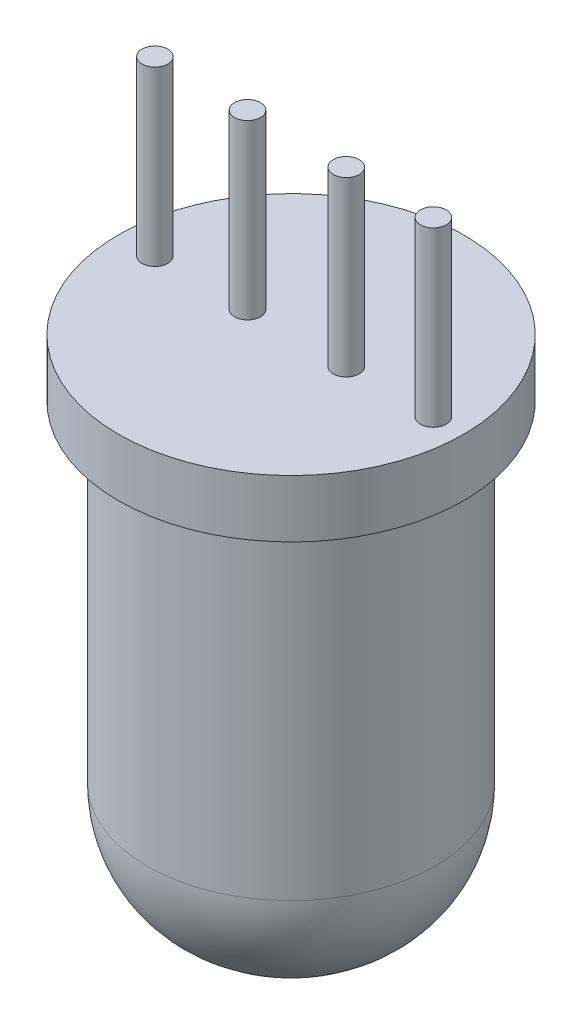
ISO-10303-21;
HEADER;
FILE_DESCRIPTION(('STEP AP214'),'2;1');
FILE_NAME('part.step','',(''),(''),'','','');
FILE_SCHEMA(('AUTOMOTIVE_DESIGN { 1 0 10303 214 1 1 1 1 }'));
ENDSEC;
DATA;
#1=APPLICATION_CONTEXT('core data for automotive mechanical design processes');
#2=APPLICATION_PROTOCOL_DEFINITION('international standard','automotive_design',2000,#1);
#3=PRODUCT_CONTEXT('',#1,'mechanical');
#4=PRODUCT('Part','Part','',(#3));
#5=PRODUCT_RELATED_PRODUCT_CATEGORY('part','',(#4));
#6=PRODUCT_DEFINITION_FORMATION('','',#4);
#7=PRODUCT_DEFINITION_CONTEXT('part definition',#1,'design');
#8=PRODUCT_DEFINITION('design','',#6,#7);
#9=PRODUCT_DEFINITION_SHAPE('','',#8);
#10=(LENGTH_UNIT() NAMED_UNIT(*) SI_UNIT(.MILLI.,.METRE.));
#11=(NAMED_UNIT(*) PLANE_ANGLE_UNIT() SI_UNIT($,.RADIAN.));
#12=(NAMED_UNIT(*) SI_UNIT($,.STERADIAN.) SOLID_ANGLE_UNIT());
#13=UNCERTAINTY_MEASURE_WITH_UNIT(LENGTH_MEASURE(1.E-05),#10,'distance_accuracy_value','');
#14=(GEOMETRIC_REPRESENTATION_CONTEXT(3) GLOBAL_UNCERTAINTY_ASSIGNED_CONTEXT((#13)) GLOBAL_UNIT_ASSIGNED_CONTEXT((#10,
#11,#12)) REPRESENTATION_CONTEXT('',''));
#15=CARTESIAN_POINT('',(0.,0.,0.));
#16=DIRECTION('',(0.,0.,1.));
#17=DIRECTION('',(1.,0.,0.));
#18=AXIS2_PLACEMENT_3D('',#15,#16,#17);
#19=CARTESIAN_POINT('',(0.,9.,0.));
#20=DIRECTION('',(0.,-1.,0.));
#21=DIRECTION('',(0.,0.,-1.));
#22=AXIS2_PLACEMENT_3D('',#19,#20,#21);
#23=CYLINDRICAL_SURFACE('',#22,2.5);
#24=CARTESIAN_POINT('',(0.,2.25,0.));
#25=DIRECTION('',(0.,1.,0.));
#26=DIRECTION('',(0.,0.,1.));
#27=AXIS2_PLACEMENT_3D('',#24,#25,#26);
#28=CIRCLE('',#27,2.5);
#29=CARTESIAN_POINT('',(0.,2.25,2.5));
#30=VERTEX_POINT('',#29);
#31=EDGE_CURVE('E40',#30,#30,#28,.T.);
#32=ORIENTED_EDGE('',*,*,#31,.T.);
#33=EDGE_LOOP('',(#32));
#34=FACE_BOUND('',#33,.T.);
#35=CARTESIAN_POINT('',(0.,8.,0.));
#36=DIRECTION('',(0.,1.,0.));
#37=DIRECTION('',(0.,0.,1.));
#38=AXIS2_PLACEMENT_3D('',#35,#36,#37);
#39=CIRCLE('',#38,2.5);
#40=CARTESIAN_POINT('',(0.,8.,2.5));
#41=VERTEX_POINT('',#40);
#42=EDGE_CURVE('E44',#41,#41,#39,.T.);
#43=ORIENTED_EDGE('',*,*,#42,.F.);
#44=EDGE_LOOP('',(#43));
#45=FACE_BOUND('',#44,.T.);
#46=ADVANCED_FACE('F33',(#34,#45),#23,.T.);
#47=CARTESIAN_POINT('',(0.,0.,0.));
#48=DIRECTION('',(0.,1.,0.));
#49=DIRECTION('',(0.,0.,1.));
#50=AXIS2_PLACEMENT_3D('',#47,#48,#49);
#51=PLANE('',#50);
#52=CARTESIAN_POINT('',(0.,0.,0.));
#53=DIRECTION('',(0.,1.,0.));
#54=DIRECTION('',(0.,0.,1.));
#55=AXIS2_PLACEMENT_3D('',#52,#53,#54);
#56=CIRCLE('',#55,0.25);
#57=CARTESIAN_POINT('',(0.,0.,0.25));
#58=VERTEX_POINT('',#57);
#59=EDGE_CURVE('E10',#58,#58,#56,.F.);
#60=ORIENTED_EDGE('',*,*,#59,.T.);
#61=EDGE_LOOP('',(#60));
#62=FACE_BOUND('',#61,.T.);
#63=ADVANCED_FACE('F105',(#62),#51,.F.);
#64=CARTESIAN_POINT('',(0.,8.,0.));
#65=DIRECTION('',(0.,1.,0.));
#66=DIRECTION('',(0.,0.,1.));
#67=AXIS2_PLACEMENT_3D('',#64,#65,#66);
#68=CYLINDRICAL_SURFACE('',#67,3.);
#69=CARTESIAN_POINT('',(0.,8.,0.));
#70=DIRECTION('',(0.,1.,0.));
#71=DIRECTION('',(0.,0.,1.));
#72=AXIS2_PLACEMENT_3D('',#69,#70,#71);
#73=CIRCLE('',#72,3.);
#74=CARTESIAN_POINT('',(0.,8.,3.));
#75=VERTEX_POINT('',#74);
#76=EDGE_CURVE('E48',#75,#75,#73,.T.);
#77=ORIENTED_EDGE('',*,*,#76,.T.);
#78=EDGE_LOOP('',(#77));
#79=FACE_BOUND('',#78,.T.);
#80=CARTESIAN_POINT('',(0.,9.,0.));
#81=DIRECTION('',(0.,1.,0.));
#82=DIRECTION('',(0.,0.,1.));
#83=AXIS2_PLACEMENT_3D('',#80,#81,#82);
#84=CIRCLE('',#83,3.);
#85=CARTESIAN_POINT('',(0.,9.,3.));
#86=VERTEX_POINT('',#85);
#87=EDGE_CURVE('E51',#86,#86,#84,.T.);
#88=ORIENTED_EDGE('',*,*,#87,.F.);
#89=EDGE_LOOP('',(#88));
#90=FACE_BOUND('',#89,.T.);
#91=ADVANCED_FACE('F103',(#79,#90),#68,.T.);
#92=CARTESIAN_POINT('',(0.,8.,0.));
#93=DIRECTION('',(0.,1.,0.));
#94=DIRECTION('',(0.,0.,1.));
#95=AXIS2_PLACEMENT_3D('',#92,#93,#94);
#96=PLANE('',#95);
#97=ORIENTED_EDGE('',*,*,#42,.T.);
#98=EDGE_LOOP('',(#97));
#99=FACE_BOUND('',#98,.T.);
#100=ORIENTED_EDGE('',*,*,#76,.F.);
#101=EDGE_LOOP('',(#100));
#102=FACE_BOUND('',#101,.T.);
#103=ADVANCED_FACE('F93',(#99,#102),#96,.F.);
#104=CARTESIAN_POINT('',(0.,9.,0.));
#105=DIRECTION('',(0.,1.,0.));
#106=DIRECTION('',(0.,0.,1.));
#107=AXIS2_PLACEMENT_3D('',#104,#105,#106);
#108=PLANE('',#107);
#109=CARTESIAN_POINT('',(2.47263070667532,9.,0.));
#110=DIRECTION('',(0.,1.,0.));
#111=DIRECTION('',(0.,0.,1.));
#112=AXIS2_PLACEMENT_3D('',#109,#110,#111);
#113=CIRCLE('',#112,0.224891601655141);
#114=CARTESIAN_POINT('',(2.47263070667532,9.,0.224891601655141));
#115=VERTEX_POINT('',#114);
#116=EDGE_CURVE('E75',#115,#115,#113,.T.);
#117=ORIENTED_EDGE('',*,*,#116,.F.);
#118=EDGE_LOOP('',(#117));
#119=FACE_BOUND('',#118,.T.);
#120=CARTESIAN_POINT('',(0.959210187934392,9.,0.));
#121=DIRECTION('',(0.,1.,0.));
#122=DIRECTION('',(0.,0.,1.));
#123=AXIS2_PLACEMENT_3D('',#120,#121,#122);
#124=CIRCLE('',#123,0.224891601655141);
#125=CARTESIAN_POINT('',(0.959210187934392,9.,0.224891601655141));
#126=VERTEX_POINT('',#125);
#127=EDGE_CURVE('E69',#126,#126,#124,.T.);
#128=ORIENTED_EDGE('',*,*,#127,.F.);
#129=EDGE_LOOP('',(#128));
#130=FACE_BOUND('',#129,.T.);
#131=CARTESIAN_POINT('',(-0.756710259370465,9.,0.));
#132=DIRECTION('',(0.,1.,0.));
#133=DIRECTION('',(0.,0.,1.));
#134=AXIS2_PLACEMENT_3D('',#131,#132,#133);
#135=CIRCLE('',#134,0.224891601655141);
#136=CARTESIAN_POINT('',(-0.756710259370465,9.,0.224891601655141));
#137=VERTEX_POINT('',#136);
#138=EDGE_CURVE('E63',#137,#137,#135,.T.);
#139=ORIENTED_EDGE('',*,*,#138,.F.);
#140=EDGE_LOOP('',(#139));
#141=FACE_BOUND('',#140,.T.);
#142=CARTESIAN_POINT('',(-2.36605179690483,9.,0.));
#143=DIRECTION('',(0.,1.,0.));
#144=DIRECTION('',(0.,0.,1.));
#145=AXIS2_PLACEMENT_3D('',#142,#143,#144);
#146=CIRCLE('',#145,0.224891601655141);
#147=CARTESIAN_POINT('',(-2.36605179690483,9.,0.224891601655141));
#148=VERTEX_POINT('',#147);
#149=EDGE_CURVE('E57',#148,#148,#146,.T.);
#150=ORIENTED_EDGE('',*,*,#149,.F.);
#151=EDGE_LOOP('',(#150));
#152=FACE_BOUND('',#151,.T.);
#153=ORIENTED_EDGE('',*,*,#87,.T.);
#154=EDGE_LOOP('',(#153));
#155=FACE_BOUND('',#154,.T.);
#156=ADVANCED_FACE('F90',(#119,#130,#141,#152,#155),#108,.T.);
#157=CARTESIAN_POINT('',(0.,2.25,0.));
#158=DIRECTION('',(0.,1.,0.));
#159=DIRECTION('',(0.,0.,1.));
#160=AXIS2_PLACEMENT_3D('',#157,#158,#159);
#161=DEGENERATE_TOROIDAL_SURFACE('',#160,0.25,2.25,.T.);
#162=ORIENTED_EDGE('',*,*,#59,.F.);
#163=EDGE_LOOP('',(#162));
#164=FACE_BOUND('',#163,.T.);
#165=ORIENTED_EDGE('',*,*,#31,.F.);
#166=EDGE_LOOP('',(#165));
#167=FACE_BOUND('',#166,.T.);
#168=ADVANCED_FACE('F35',(#164,#167),#161,.T.);
#169=CARTESIAN_POINT('',(-2.36605179690483,12.,0.));
#170=DIRECTION('',(0.,-1.,0.));
#171=DIRECTION('',(0.,0.,-1.));
#172=AXIS2_PLACEMENT_3D('',#169,#170,#171);
#173=CYLINDRICAL_SURFACE('',#172,0.224891601655141);
#174=CARTESIAN_POINT('',(-2.36605179690483,12.,0.));
#175=DIRECTION('',(0.,1.,0.));
#176=DIRECTION('',(0.,0.,1.));
#177=AXIS2_PLACEMENT_3D('',#174,#175,#176);
#178=CIRCLE('',#177,0.224891601655141);
#179=CARTESIAN_POINT('',(-2.36605179690483,12.,0.224891601655141));
#180=VERTEX_POINT('',#179);
#181=EDGE_CURVE('E54',#180,#180,#178,.T.);
#182=ORIENTED_EDGE('',*,*,#181,.F.);
#183=EDGE_LOOP('',(#182));
#184=FACE_BOUND('',#183,.T.);
#185=ORIENTED_EDGE('',*,*,#149,.T.);
#186=EDGE_LOOP('',(#185));
#187=FACE_BOUND('',#186,.T.);
#188=ADVANCED_FACE('F134',(#184,#187),#173,.T.);
#189=CARTESIAN_POINT('',(-2.36605179690483,12.,0.));
#190=DIRECTION('',(0.,1.,0.));
#191=DIRECTION('',(0.,0.,1.));
#192=AXIS2_PLACEMENT_3D('',#189,#190,#191);
#193=PLANE('',#192);
#194=ORIENTED_EDGE('',*,*,#181,.T.);
#195=EDGE_LOOP('',(#194));
#196=FACE_BOUND('',#195,.T.);
#197=ADVANCED_FACE('F145',(#196),#193,.T.);
#198=CARTESIAN_POINT('',(-0.756710259370465,12.,0.));
#199=DIRECTION('',(0.,-1.,0.));
#200=DIRECTION('',(0.,0.,-1.));
#201=AXIS2_PLACEMENT_3D('',#198,#199,#200);
#202=CYLINDRICAL_SURFACE('',#201,0.224891601655141);
#203=CARTESIAN_POINT('',(-0.756710259370465,12.,0.));
#204=DIRECTION('',(0.,1.,0.));
#205=DIRECTION('',(0.,0.,1.));
#206=AXIS2_PLACEMENT_3D('',#203,#204,#205);
#207=CIRCLE('',#206,0.224891601655141);
#208=CARTESIAN_POINT('',(-0.756710259370465,12.,0.224891601655141));
#209=VERTEX_POINT('',#208);
#210=EDGE_CURVE('E60',#209,#209,#207,.T.);
#211=ORIENTED_EDGE('',*,*,#210,.F.);
#212=EDGE_LOOP('',(#211));
#213=FACE_BOUND('',#212,.T.);
#214=ORIENTED_EDGE('',*,*,#138,.T.);
#215=EDGE_LOOP('',(#214));
#216=FACE_BOUND('',#215,.T.);
#217=ADVANCED_FACE('F153',(#213,#216),#202,.T.);
#218=CARTESIAN_POINT('',(-0.756710259370465,12.,0.));
#219=DIRECTION('',(0.,1.,0.));
#220=DIRECTION('',(0.,0.,1.));
#221=AXIS2_PLACEMENT_3D('',#218,#219,#220);
#222=PLANE('',#221);
#223=ORIENTED_EDGE('',*,*,#210,.T.);
#224=EDGE_LOOP('',(#223));
#225=FACE_BOUND('',#224,.T.);
#226=ADVANCED_FACE('F161',(#225),#222,.T.);
#227=CARTESIAN_POINT('',(0.959210187934392,12.,0.));
#228=DIRECTION('',(0.,-1.,0.));
#229=DIRECTION('',(0.,0.,-1.));
#230=AXIS2_PLACEMENT_3D('',#227,#228,#229);
#231=CYLINDRICAL_SURFACE('',#230,0.224891601655141);
#232=CARTESIAN_POINT('',(0.959210187934392,12.,0.));
#233=DIRECTION('',(0.,1.,0.));
#234=DIRECTION('',(0.,0.,1.));
#235=AXIS2_PLACEMENT_3D('',#232,#233,#234);
#236=CIRCLE('',#235,0.224891601655141);
#237=CARTESIAN_POINT('',(0.959210187934392,12.,0.224891601655141));
#238=VERTEX_POINT('',#237);
#239=EDGE_CURVE('E66',#238,#238,#236,.T.);
#240=ORIENTED_EDGE('',*,*,#239,.F.);
#241=EDGE_LOOP('',(#240));
#242=FACE_BOUND('',#241,.T.);
#243=ORIENTED_EDGE('',*,*,#127,.T.);
#244=EDGE_LOOP('',(#243));
#245=FACE_BOUND('',#244,.T.);
#246=ADVANCED_FACE('F169',(#242,#245),#231,.T.);
#247=CARTESIAN_POINT('',(0.959210187934392,12.,0.));
#248=DIRECTION('',(0.,1.,0.));
#249=DIRECTION('',(0.,0.,1.));
#250=AXIS2_PLACEMENT_3D('',#247,#248,#249);
#251=PLANE('',#250);
#252=ORIENTED_EDGE('',*,*,#239,.T.);
#253=EDGE_LOOP('',(#252));
#254=FACE_BOUND('',#253,.T.);
#255=ADVANCED_FACE('F86',(#254),#251,.T.);
#256=CARTESIAN_POINT('',(2.47263070667532,12.,0.));
#257=DIRECTION('',(0.,-1.,0.));
#258=DIRECTION('',(0.,0.,-1.));
#259=AXIS2_PLACEMENT_3D('',#256,#257,#258);
#260=CYLINDRICAL_SURFACE('',#259,0.224891601655141);
#261=CARTESIAN_POINT('',(2.47263070667532,12.,0.));
#262=DIRECTION('',(0.,1.,0.));
#263=DIRECTION('',(0.,0.,1.));
#264=AXIS2_PLACEMENT_3D('',#261,#262,#263);
#265=CIRCLE('',#264,0.224891601655141);
#266=CARTESIAN_POINT('',(2.47263070667532,12.,0.224891601655141));
#267=VERTEX_POINT('',#266);
#268=EDGE_CURVE('E72',#267,#267,#265,.T.);
#269=ORIENTED_EDGE('',*,*,#268,.F.);
#270=EDGE_LOOP('',(#269));
#271=FACE_BOUND('',#270,.T.);
#272=ORIENTED_EDGE('',*,*,#116,.T.);
#273=EDGE_LOOP('',(#272));
#274=FACE_BOUND('',#273,.T.);
#275=ADVANCED_FACE('F83',(#271,#274),#260,.T.);
#276=CARTESIAN_POINT('',(2.47263070667532,12.,0.));
#277=DIRECTION('',(0.,1.,0.));
#278=DIRECTION('',(0.,0.,1.));
#279=AXIS2_PLACEMENT_3D('',#276,#277,#278);
#280=PLANE('',#279);
#281=ORIENTED_EDGE('',*,*,#268,.T.);
#282=EDGE_LOOP('',(#281));
#283=FACE_BOUND('',#282,.T.);
#284=ADVANCED_FACE('F81',(#283),#280,.T.);
#285=CLOSED_SHELL('',(#46,#63,#91,#103,#156,#168,#188,#197,#217,#226,#246,#255,#275,#284));
#286=MANIFOLD_SOLID_BREP('B2',#285);
#287=ADVANCED_BREP_SHAPE_REPRESENTATION('',(#18,#286),#14);
#288=SHAPE_DEFINITION_REPRESENTATION(#9,#287);
ENDSEC;
END-ISO-10303-21;
